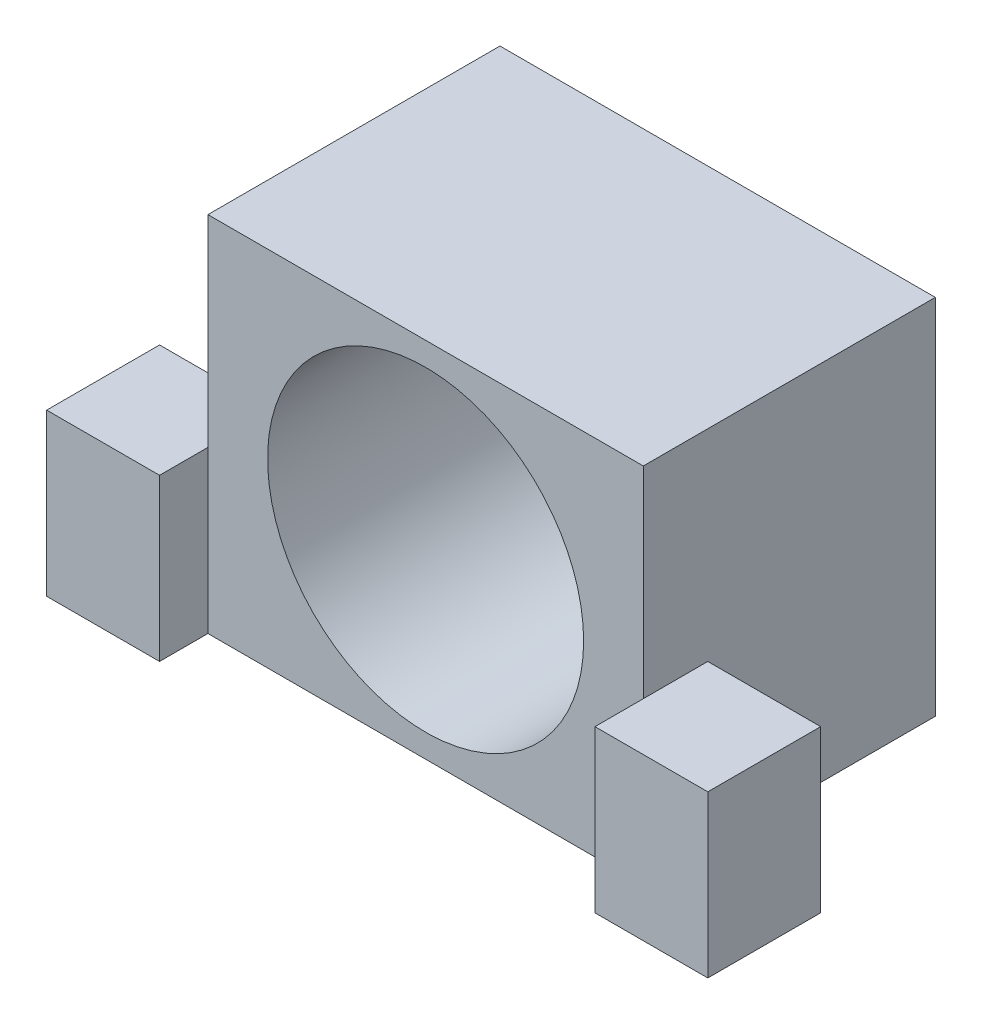
ISO-10303-21;
HEADER;
FILE_DESCRIPTION(('STEP AP214'),'2;1');
FILE_NAME('part.step','',(''),(''),'','','');
FILE_SCHEMA(('AUTOMOTIVE_DESIGN { 1 0 10303 214 1 1 1 1 }'));
ENDSEC;
DATA;
#1=APPLICATION_CONTEXT('core data for automotive mechanical design processes');
#2=APPLICATION_PROTOCOL_DEFINITION('international standard','automotive_design',2000,#1);
#3=PRODUCT_CONTEXT('',#1,'mechanical');
#4=PRODUCT('Part','Part','',(#3));
#5=PRODUCT_RELATED_PRODUCT_CATEGORY('part','',(#4));
#6=PRODUCT_DEFINITION_FORMATION('','',#4);
#7=PRODUCT_DEFINITION_CONTEXT('part definition',#1,'design');
#8=PRODUCT_DEFINITION('design','',#6,#7);
#9=PRODUCT_DEFINITION_SHAPE('','',#8);
#10=(LENGTH_UNIT() NAMED_UNIT(*) SI_UNIT(.MILLI.,.METRE.));
#11=(NAMED_UNIT(*) PLANE_ANGLE_UNIT() SI_UNIT($,.RADIAN.));
#12=(NAMED_UNIT(*) SI_UNIT($,.STERADIAN.) SOLID_ANGLE_UNIT());
#13=UNCERTAINTY_MEASURE_WITH_UNIT(LENGTH_MEASURE(1.E-05),#10,'distance_accuracy_value','');
#14=(GEOMETRIC_REPRESENTATION_CONTEXT(3) GLOBAL_UNCERTAINTY_ASSIGNED_CONTEXT((#13)) GLOBAL_UNIT_ASSIGNED_CONTEXT((#10,
#11,#12)) REPRESENTATION_CONTEXT('',''));
#15=CARTESIAN_POINT('',(0.,0.,0.));
#16=DIRECTION('',(0.,0.,1.));
#17=DIRECTION('',(1.,0.,0.));
#18=AXIS2_PLACEMENT_3D('',#15,#16,#17);
#19=CARTESIAN_POINT('',(17.145,14.2875,23.));
#20=DIRECTION('',(-1.,0.,0.));
#21=DIRECTION('',(0.,0.,1.));
#22=AXIS2_PLACEMENT_3D('',#19,#20,#21);
#23=PLANE('',#22);
#24=DIRECTION('',(0.,0.,1.));
#25=VECTOR('',#24,1.);
#26=CARTESIAN_POINT('',(17.145,-1.5875,17.92));
#27=LINE('',#26,#25);
#28=CARTESIAN_POINT('',(17.145,-1.5875,17.92));
#29=VERTEX_POINT('',#28);
#30=CARTESIAN_POINT('',(17.145,-1.5875,23.));
#31=VERTEX_POINT('',#30);
#32=EDGE_CURVE('E166',#29,#31,#27,.T.);
#33=ORIENTED_EDGE('',*,*,#32,.F.);
#34=DIRECTION('',(0.,-1.,0.));
#35=VECTOR('',#34,1.);
#36=CARTESIAN_POINT('',(17.145,-1.5875,17.92));
#37=LINE('',#36,#35);
#38=CARTESIAN_POINT('',(17.145,-14.2875,17.92));
#39=VERTEX_POINT('',#38);
#40=EDGE_CURVE('E158',#29,#39,#37,.T.);
#41=ORIENTED_EDGE('',*,*,#40,.T.);
#42=DIRECTION('',(0.,0.,-1.));
#43=VECTOR('',#42,1.);
#44=CARTESIAN_POINT('',(17.145,-14.2875,23.));
#45=LINE('',#44,#43);
#46=CARTESIAN_POINT('',(17.145,-14.2875,0.));
#47=VERTEX_POINT('',#46);
#48=EDGE_CURVE('E40',#39,#47,#45,.T.);
#49=ORIENTED_EDGE('',*,*,#48,.T.);
#50=DIRECTION('',(0.,1.,0.));
#51=VECTOR('',#50,1.);
#52=CARTESIAN_POINT('',(17.145,14.2875,0.));
#53=LINE('',#52,#51);
#54=CARTESIAN_POINT('',(17.145,14.2875,0.));
#55=VERTEX_POINT('',#54);
#56=EDGE_CURVE('E257',#47,#55,#53,.T.);
#57=ORIENTED_EDGE('',*,*,#56,.T.);
#58=DIRECTION('',(0.,0.,-1.));
#59=VECTOR('',#58,1.);
#60=CARTESIAN_POINT('',(17.145,14.2875,23.));
#61=LINE('',#60,#59);
#62=CARTESIAN_POINT('',(17.145,14.2875,23.));
#63=VERTEX_POINT('',#62);
#64=EDGE_CURVE('E263',#63,#55,#61,.T.);
#65=ORIENTED_EDGE('',*,*,#64,.F.);
#66=DIRECTION('',(0.,1.,0.));
#67=VECTOR('',#66,1.);
#68=CARTESIAN_POINT('',(17.145,14.2875,23.));
#69=LINE('',#68,#67);
#70=EDGE_CURVE('E248',#31,#63,#69,.T.);
#71=ORIENTED_EDGE('',*,*,#70,.F.);
#72=EDGE_LOOP('',(#33,#41,#49,#57,#65,#71));
#73=FACE_BOUND('',#72,.T.);
#74=ADVANCED_FACE('F32',(#73),#23,.F.);
#75=CARTESIAN_POINT('',(-17.145,14.2875,23.));
#76=DIRECTION('',(1.,0.,0.));
#77=DIRECTION('',(0.,0.,-1.));
#78=AXIS2_PLACEMENT_3D('',#75,#76,#77);
#79=PLANE('',#78);
#80=DIRECTION('',(0.,1.,0.));
#81=VECTOR('',#80,1.);
#82=CARTESIAN_POINT('',(-17.145,-1.5875,17.92));
#83=LINE('',#82,#81);
#84=CARTESIAN_POINT('',(-17.145,-14.2875,17.92));
#85=VERTEX_POINT('',#84);
#86=CARTESIAN_POINT('',(-17.145,-1.5875,17.92));
#87=VERTEX_POINT('',#86);
#88=EDGE_CURVE('E185',#85,#87,#83,.T.);
#89=ORIENTED_EDGE('',*,*,#88,.T.);
#90=DIRECTION('',(0.,0.,1.));
#91=VECTOR('',#90,1.);
#92=CARTESIAN_POINT('',(-17.145,-1.5875,17.92));
#93=LINE('',#92,#91);
#94=CARTESIAN_POINT('',(-17.145,-1.5875,23.));
#95=VERTEX_POINT('',#94);
#96=EDGE_CURVE('E203',#87,#95,#93,.T.);
#97=ORIENTED_EDGE('',*,*,#96,.T.);
#98=DIRECTION('',(0.,-1.,0.));
#99=VECTOR('',#98,1.);
#100=CARTESIAN_POINT('',(-17.145,14.2875,23.));
#101=LINE('',#100,#99);
#102=CARTESIAN_POINT('',(-17.145,14.2875,23.));
#103=VERTEX_POINT('',#102);
#104=EDGE_CURVE('E242',#103,#95,#101,.T.);
#105=ORIENTED_EDGE('',*,*,#104,.F.);
#106=DIRECTION('',(0.,0.,-1.));
#107=VECTOR('',#106,1.);
#108=CARTESIAN_POINT('',(-17.145,14.2875,23.));
#109=LINE('',#108,#107);
#110=CARTESIAN_POINT('',(-17.145,14.2875,0.));
#111=VERTEX_POINT('',#110);
#112=EDGE_CURVE('E252',#103,#111,#109,.T.);
#113=ORIENTED_EDGE('',*,*,#112,.T.);
#114=DIRECTION('',(0.,-1.,0.));
#115=VECTOR('',#114,1.);
#116=CARTESIAN_POINT('',(-17.145,14.2875,0.));
#117=LINE('',#116,#115);
#118=CARTESIAN_POINT('',(-17.145,-14.2875,0.));
#119=VERTEX_POINT('',#118);
#120=EDGE_CURVE('E239',#111,#119,#117,.T.);
#121=ORIENTED_EDGE('',*,*,#120,.T.);
#122=DIRECTION('',(0.,0.,-1.));
#123=VECTOR('',#122,1.);
#124=CARTESIAN_POINT('',(-17.145,-14.2875,23.));
#125=LINE('',#124,#123);
#126=EDGE_CURVE('E11',#85,#119,#125,.T.);
#127=ORIENTED_EDGE('',*,*,#126,.F.);
#128=EDGE_LOOP('',(#89,#97,#105,#113,#121,#127));
#129=FACE_BOUND('',#128,.T.);
#130=ADVANCED_FACE('F34',(#129),#79,.F.);
#131=CARTESIAN_POINT('',(17.145,-14.2875,23.));
#132=DIRECTION('',(0.,1.,0.));
#133=DIRECTION('',(0.,0.,1.));
#134=AXIS2_PLACEMENT_3D('',#131,#132,#133);
#135=PLANE('',#134);
#136=DIRECTION('',(1.,0.,0.));
#137=VECTOR('',#136,1.);
#138=CARTESIAN_POINT('',(17.145,-14.2875,0.));
#139=LINE('',#138,#137);
#140=EDGE_CURVE('E255',#119,#47,#139,.T.);
#141=ORIENTED_EDGE('',*,*,#140,.T.);
#142=ORIENTED_EDGE('',*,*,#48,.F.);
#143=DIRECTION('',(1.,0.,0.));
#144=VECTOR('',#143,1.);
#145=CARTESIAN_POINT('',(17.145,-14.2875,17.92));
#146=LINE('',#145,#144);
#147=CARTESIAN_POINT('',(26.035,-14.2875,17.92));
#148=VERTEX_POINT('',#147);
#149=EDGE_CURVE('E47',#39,#148,#146,.T.);
#150=ORIENTED_EDGE('',*,*,#149,.T.);
#151=DIRECTION('',(0.,0.,1.));
#152=VECTOR('',#151,1.);
#153=CARTESIAN_POINT('',(26.035,-14.2875,17.92));
#154=LINE('',#153,#152);
#155=CARTESIAN_POINT('',(26.035,-14.2875,26.81));
#156=VERTEX_POINT('',#155);
#157=EDGE_CURVE('E138',#148,#156,#154,.T.);
#158=ORIENTED_EDGE('',*,*,#157,.T.);
#159=DIRECTION('',(1.,0.,0.));
#160=VECTOR('',#159,1.);
#161=CARTESIAN_POINT('',(17.145,-14.2875,26.81));
#162=LINE('',#161,#160);
#163=CARTESIAN_POINT('',(17.145,-14.2875,26.81));
#164=VERTEX_POINT('',#163);
#165=EDGE_CURVE('E142',#164,#156,#162,.T.);
#166=ORIENTED_EDGE('',*,*,#165,.F.);
#167=DIRECTION('',(0.,0.,1.));
#168=VECTOR('',#167,1.);
#169=CARTESIAN_POINT('',(17.145,-14.2875,17.92));
#170=LINE('',#169,#168);
#171=CARTESIAN_POINT('',(17.145,-14.2875,23.));
#172=VERTEX_POINT('',#171);
#173=EDGE_CURVE('E128',#172,#164,#170,.T.);
#174=ORIENTED_EDGE('',*,*,#173,.F.);
#175=DIRECTION('',(1.,0.,0.));
#176=VECTOR('',#175,1.);
#177=CARTESIAN_POINT('',(17.145,-14.2875,23.));
#178=LINE('',#177,#176);
#179=CARTESIAN_POINT('',(-17.145,-14.2875,23.));
#180=VERTEX_POINT('',#179);
#181=EDGE_CURVE('E245',#180,#172,#178,.T.);
#182=ORIENTED_EDGE('',*,*,#181,.F.);
#183=DIRECTION('',(0.,0.,1.));
#184=VECTOR('',#183,1.);
#185=CARTESIAN_POINT('',(-17.145,-14.2875,17.92));
#186=LINE('',#185,#184);
#187=CARTESIAN_POINT('',(-17.145,-14.2875,26.81));
#188=VERTEX_POINT('',#187);
#189=EDGE_CURVE('E196',#180,#188,#186,.T.);
#190=ORIENTED_EDGE('',*,*,#189,.T.);
#191=DIRECTION('',(1.,0.,0.));
#192=VECTOR('',#191,1.);
#193=CARTESIAN_POINT('',(-17.145,-14.2875,26.81));
#194=LINE('',#193,#192);
#195=CARTESIAN_POINT('',(-26.035,-14.2875,26.81));
#196=VERTEX_POINT('',#195);
#197=EDGE_CURVE('E182',#196,#188,#194,.T.);
#198=ORIENTED_EDGE('',*,*,#197,.F.);
#199=DIRECTION('',(0.,0.,1.));
#200=VECTOR('',#199,1.);
#201=CARTESIAN_POINT('',(-26.035,-14.2875,17.92));
#202=LINE('',#201,#200);
#203=CARTESIAN_POINT('',(-26.035,-14.2875,17.92));
#204=VERTEX_POINT('',#203);
#205=EDGE_CURVE('E199',#204,#196,#202,.T.);
#206=ORIENTED_EDGE('',*,*,#205,.F.);
#207=DIRECTION('',(1.,0.,0.));
#208=VECTOR('',#207,1.);
#209=CARTESIAN_POINT('',(-17.145,-14.2875,17.92));
#210=LINE('',#209,#208);
#211=EDGE_CURVE('E192',#204,#85,#210,.T.);
#212=ORIENTED_EDGE('',*,*,#211,.T.);
#213=ORIENTED_EDGE('',*,*,#126,.T.);
#214=EDGE_LOOP('',(#141,#142,#150,#158,#166,#174,#182,#190,#198,#206,#212,#213));
#215=FACE_BOUND('',#214,.T.);
#216=ADVANCED_FACE('F144',(#215),#135,.F.);
#217=CARTESIAN_POINT('',(-17.145,14.2875,23.));
#218=DIRECTION('',(0.,-1.,0.));
#219=DIRECTION('',(0.,0.,-1.));
#220=AXIS2_PLACEMENT_3D('',#217,#218,#219);
#221=PLANE('',#220);
#222=DIRECTION('',(-1.,0.,0.));
#223=VECTOR('',#222,1.);
#224=CARTESIAN_POINT('',(-17.145,14.2875,0.));
#225=LINE('',#224,#223);
#226=EDGE_CURVE('E259',#55,#111,#225,.T.);
#227=ORIENTED_EDGE('',*,*,#226,.T.);
#228=ORIENTED_EDGE('',*,*,#112,.F.);
#229=DIRECTION('',(-1.,0.,0.));
#230=VECTOR('',#229,1.);
#231=CARTESIAN_POINT('',(-17.145,14.2875,23.));
#232=LINE('',#231,#230);
#233=EDGE_CURVE('E250',#63,#103,#232,.T.);
#234=ORIENTED_EDGE('',*,*,#233,.F.);
#235=ORIENTED_EDGE('',*,*,#64,.T.);
#236=EDGE_LOOP('',(#227,#228,#234,#235));
#237=FACE_BOUND('',#236,.T.);
#238=ADVANCED_FACE('F278',(#237),#221,.F.);
#239=CARTESIAN_POINT('',(0.,0.,23.));
#240=DIRECTION('',(0.,0.,-1.));
#241=DIRECTION('',(-1.,0.,0.));
#242=AXIS2_PLACEMENT_3D('',#239,#240,#241);
#243=PLANE('',#242);
#244=CARTESIAN_POINT('',(0.,0.,23.));
#245=DIRECTION('',(0.,0.,1.));
#246=DIRECTION('',(1.,0.,0.));
#247=AXIS2_PLACEMENT_3D('',#244,#245,#246);
#248=CIRCLE('',#247,12.446);
#249=CARTESIAN_POINT('',(12.446,0.,23.));
#250=VERTEX_POINT('',#249);
#251=EDGE_CURVE('E233',#250,#250,#248,.T.);
#252=ORIENTED_EDGE('',*,*,#251,.F.);
#253=EDGE_LOOP('',(#252));
#254=FACE_BOUND('',#253,.T.);
#255=ORIENTED_EDGE('',*,*,#104,.T.);
#256=EDGE_CURVE('E246',#95,#180,#101,.T.);
#257=ORIENTED_EDGE('',*,*,#256,.T.);
#258=ORIENTED_EDGE('',*,*,#181,.T.);
#259=EDGE_CURVE('E134',#172,#31,#69,.T.);
#260=ORIENTED_EDGE('',*,*,#259,.T.);
#261=ORIENTED_EDGE('',*,*,#70,.T.);
#262=ORIENTED_EDGE('',*,*,#233,.T.);
#263=EDGE_LOOP('',(#255,#257,#258,#260,#261,#262));
#264=FACE_BOUND('',#263,.T.);
#265=ADVANCED_FACE('F284',(#254,#264),#243,.F.);
#266=CARTESIAN_POINT('',(0.,0.,0.));
#267=DIRECTION('',(0.,0.,-1.));
#268=DIRECTION('',(-1.,0.,0.));
#269=AXIS2_PLACEMENT_3D('',#266,#267,#268);
#270=PLANE('',#269);
#271=CARTESIAN_POINT('',(0.,0.,0.));
#272=DIRECTION('',(0.,0.,1.));
#273=DIRECTION('',(1.,0.,0.));
#274=AXIS2_PLACEMENT_3D('',#271,#272,#273);
#275=CIRCLE('',#274,3.75);
#276=CARTESIAN_POINT('',(3.75,0.,0.));
#277=VERTEX_POINT('',#276);
#278=EDGE_CURVE('E213',#277,#277,#275,.T.);
#279=ORIENTED_EDGE('',*,*,#278,.T.);
#280=EDGE_LOOP('',(#279));
#281=FACE_BOUND('',#280,.T.);
#282=CARTESIAN_POINT('',(0.,-8.5,0.));
#283=DIRECTION('',(0.,0.,1.));
#284=DIRECTION('',(1.,0.,0.));
#285=AXIS2_PLACEMENT_3D('',#282,#283,#284);
#286=CIRCLE('',#285,1.625);
#287=CARTESIAN_POINT('',(1.625,-8.5,0.));
#288=VERTEX_POINT('',#287);
#289=EDGE_CURVE('E206',#288,#288,#286,.T.);
#290=ORIENTED_EDGE('',*,*,#289,.T.);
#291=EDGE_LOOP('',(#290));
#292=FACE_BOUND('',#291,.T.);
#293=CARTESIAN_POINT('',(8.5,0.,0.));
#294=DIRECTION('',(0.,0.,1.));
#295=DIRECTION('',(1.,0.,0.));
#296=AXIS2_PLACEMENT_3D('',#293,#294,#295);
#297=CIRCLE('',#296,1.625);
#298=CARTESIAN_POINT('',(10.125,0.,0.));
#299=VERTEX_POINT('',#298);
#300=EDGE_CURVE('E225',#299,#299,#297,.T.);
#301=ORIENTED_EDGE('',*,*,#300,.T.);
#302=EDGE_LOOP('',(#301));
#303=FACE_BOUND('',#302,.T.);
#304=CARTESIAN_POINT('',(-8.5,0.,0.));
#305=DIRECTION('',(0.,0.,1.));
#306=DIRECTION('',(1.,0.,0.));
#307=AXIS2_PLACEMENT_3D('',#304,#305,#306);
#308=CIRCLE('',#307,1.625);
#309=CARTESIAN_POINT('',(-6.875,0.,0.));
#310=VERTEX_POINT('',#309);
#311=EDGE_CURVE('E218',#310,#310,#308,.T.);
#312=ORIENTED_EDGE('',*,*,#311,.T.);
#313=EDGE_LOOP('',(#312));
#314=FACE_BOUND('',#313,.T.);
#315=CARTESIAN_POINT('',(0.,8.5,0.));
#316=DIRECTION('',(0.,0.,1.));
#317=DIRECTION('',(1.,0.,0.));
#318=AXIS2_PLACEMENT_3D('',#315,#316,#317);
#319=CIRCLE('',#318,1.625);
#320=CARTESIAN_POINT('',(1.625,8.5,0.));
#321=VERTEX_POINT('',#320);
#322=EDGE_CURVE('E230',#321,#321,#319,.T.);
#323=ORIENTED_EDGE('',*,*,#322,.T.);
#324=EDGE_LOOP('',(#323));
#325=FACE_BOUND('',#324,.T.);
#326=ORIENTED_EDGE('',*,*,#120,.F.);
#327=ORIENTED_EDGE('',*,*,#226,.F.);
#328=ORIENTED_EDGE('',*,*,#56,.F.);
#329=ORIENTED_EDGE('',*,*,#140,.F.);
#330=EDGE_LOOP('',(#326,#327,#328,#329));
#331=FACE_BOUND('',#330,.T.);
#332=ADVANCED_FACE('F275',(#281,#292,#303,#314,#325,#331),#270,.T.);
#333=CARTESIAN_POINT('',(0.,0.,2.));
#334=DIRECTION('',(0.,0.,1.));
#335=DIRECTION('',(1.,0.,0.));
#336=AXIS2_PLACEMENT_3D('',#333,#334,#335);
#337=CYLINDRICAL_SURFACE('',#336,12.446);
#338=CARTESIAN_POINT('',(0.,0.,2.));
#339=DIRECTION('',(0.,0.,1.));
#340=DIRECTION('',(1.,0.,0.));
#341=AXIS2_PLACEMENT_3D('',#338,#339,#340);
#342=CIRCLE('',#341,12.446);
#343=CARTESIAN_POINT('',(12.446,0.,2.));
#344=VERTEX_POINT('',#343);
#345=EDGE_CURVE('E236',#344,#344,#342,.T.);
#346=ORIENTED_EDGE('',*,*,#345,.F.);
#347=EDGE_LOOP('',(#346));
#348=FACE_BOUND('',#347,.T.);
#349=ORIENTED_EDGE('',*,*,#251,.T.);
#350=EDGE_LOOP('',(#349));
#351=FACE_BOUND('',#350,.T.);
#352=ADVANCED_FACE('F320',(#348,#351),#337,.F.);
#353=CARTESIAN_POINT('',(0.,0.,2.));
#354=DIRECTION('',(0.,0.,1.));
#355=DIRECTION('',(1.,0.,0.));
#356=AXIS2_PLACEMENT_3D('',#353,#354,#355);
#357=PLANE('',#356);
#358=CARTESIAN_POINT('',(0.,0.,2.));
#359=DIRECTION('',(0.,0.,1.));
#360=DIRECTION('',(1.,0.,0.));
#361=AXIS2_PLACEMENT_3D('',#358,#359,#360);
#362=CIRCLE('',#361,3.75);
#363=CARTESIAN_POINT('',(3.75,0.,2.));
#364=VERTEX_POINT('',#363);
#365=EDGE_CURVE('E198',#364,#364,#362,.T.);
#366=ORIENTED_EDGE('',*,*,#365,.F.);
#367=EDGE_LOOP('',(#366));
#368=FACE_BOUND('',#367,.T.);
#369=CARTESIAN_POINT('',(0.,-8.5,2.));
#370=DIRECTION('',(0.,0.,1.));
#371=DIRECTION('',(1.,0.,0.));
#372=AXIS2_PLACEMENT_3D('',#369,#370,#371);
#373=CIRCLE('',#372,1.625);
#374=CARTESIAN_POINT('',(1.625,-8.5,2.));
#375=VERTEX_POINT('',#374);
#376=EDGE_CURVE('E210',#375,#375,#373,.T.);
#377=ORIENTED_EDGE('',*,*,#376,.F.);
#378=EDGE_LOOP('',(#377));
#379=FACE_BOUND('',#378,.T.);
#380=CARTESIAN_POINT('',(8.5,0.,2.));
#381=DIRECTION('',(0.,0.,1.));
#382=DIRECTION('',(1.,0.,0.));
#383=AXIS2_PLACEMENT_3D('',#380,#381,#382);
#384=CIRCLE('',#383,1.625);
#385=CARTESIAN_POINT('',(10.125,0.,2.));
#386=VERTEX_POINT('',#385);
#387=EDGE_CURVE('E209',#386,#386,#384,.T.);
#388=ORIENTED_EDGE('',*,*,#387,.F.);
#389=EDGE_LOOP('',(#388));
#390=FACE_BOUND('',#389,.T.);
#391=CARTESIAN_POINT('',(-8.5,0.,2.));
#392=DIRECTION('',(0.,0.,1.));
#393=DIRECTION('',(1.,0.,0.));
#394=AXIS2_PLACEMENT_3D('',#391,#392,#393);
#395=CIRCLE('',#394,1.625);
#396=CARTESIAN_POINT('',(-6.875,0.,2.));
#397=VERTEX_POINT('',#396);
#398=EDGE_CURVE('E222',#397,#397,#395,.T.);
#399=ORIENTED_EDGE('',*,*,#398,.F.);
#400=EDGE_LOOP('',(#399));
#401=FACE_BOUND('',#400,.T.);
#402=CARTESIAN_POINT('',(0.,8.5,2.));
#403=DIRECTION('',(0.,0.,1.));
#404=DIRECTION('',(1.,0.,0.));
#405=AXIS2_PLACEMENT_3D('',#402,#403,#404);
#406=CIRCLE('',#405,1.625);
#407=CARTESIAN_POINT('',(1.625,8.5,2.));
#408=VERTEX_POINT('',#407);
#409=EDGE_CURVE('E221',#408,#408,#406,.T.);
#410=ORIENTED_EDGE('',*,*,#409,.F.);
#411=EDGE_LOOP('',(#410));
#412=FACE_BOUND('',#411,.T.);
#413=ORIENTED_EDGE('',*,*,#345,.T.);
#414=EDGE_LOOP('',(#413));
#415=FACE_BOUND('',#414,.T.);
#416=ADVANCED_FACE('F326',(#368,#379,#390,#401,#412,#415),#357,.T.);
#417=CARTESIAN_POINT('',(0.,8.5,0.));
#418=DIRECTION('',(0.,0.,1.));
#419=DIRECTION('',(1.,0.,0.));
#420=AXIS2_PLACEMENT_3D('',#417,#418,#419);
#421=CYLINDRICAL_SURFACE('',#420,1.625);
#422=ORIENTED_EDGE('',*,*,#322,.F.);
#423=EDGE_LOOP('',(#422));
#424=FACE_BOUND('',#423,.T.);
#425=ORIENTED_EDGE('',*,*,#409,.T.);
#426=EDGE_LOOP('',(#425));
#427=FACE_BOUND('',#426,.T.);
#428=ADVANCED_FACE('F330',(#424,#427),#421,.F.);
#429=CARTESIAN_POINT('',(-8.5,0.,0.));
#430=DIRECTION('',(0.,0.,1.));
#431=DIRECTION('',(1.,0.,0.));
#432=AXIS2_PLACEMENT_3D('',#429,#430,#431);
#433=CYLINDRICAL_SURFACE('',#432,1.625);
#434=ORIENTED_EDGE('',*,*,#311,.F.);
#435=EDGE_LOOP('',(#434));
#436=FACE_BOUND('',#435,.T.);
#437=ORIENTED_EDGE('',*,*,#398,.T.);
#438=EDGE_LOOP('',(#437));
#439=FACE_BOUND('',#438,.T.);
#440=ADVANCED_FACE('F334',(#436,#439),#433,.F.);
#441=CARTESIAN_POINT('',(8.5,0.,0.));
#442=DIRECTION('',(0.,0.,1.));
#443=DIRECTION('',(1.,0.,0.));
#444=AXIS2_PLACEMENT_3D('',#441,#442,#443);
#445=CYLINDRICAL_SURFACE('',#444,1.625);
#446=ORIENTED_EDGE('',*,*,#300,.F.);
#447=EDGE_LOOP('',(#446));
#448=FACE_BOUND('',#447,.T.);
#449=ORIENTED_EDGE('',*,*,#387,.T.);
#450=EDGE_LOOP('',(#449));
#451=FACE_BOUND('',#450,.T.);
#452=ADVANCED_FACE('F336',(#448,#451),#445,.F.);
#453=CARTESIAN_POINT('',(0.,-8.5,0.));
#454=DIRECTION('',(0.,0.,1.));
#455=DIRECTION('',(1.,0.,0.));
#456=AXIS2_PLACEMENT_3D('',#453,#454,#455);
#457=CYLINDRICAL_SURFACE('',#456,1.625);
#458=ORIENTED_EDGE('',*,*,#289,.F.);
#459=EDGE_LOOP('',(#458));
#460=FACE_BOUND('',#459,.T.);
#461=ORIENTED_EDGE('',*,*,#376,.T.);
#462=EDGE_LOOP('',(#461));
#463=FACE_BOUND('',#462,.T.);
#464=ADVANCED_FACE('F339',(#460,#463),#457,.F.);
#465=CARTESIAN_POINT('',(0.,0.,0.));
#466=DIRECTION('',(0.,0.,1.));
#467=DIRECTION('',(1.,0.,0.));
#468=AXIS2_PLACEMENT_3D('',#465,#466,#467);
#469=CYLINDRICAL_SURFACE('',#468,3.75);
#470=ORIENTED_EDGE('',*,*,#278,.F.);
#471=EDGE_LOOP('',(#470));
#472=FACE_BOUND('',#471,.T.);
#473=ORIENTED_EDGE('',*,*,#365,.T.);
#474=EDGE_LOOP('',(#473));
#475=FACE_BOUND('',#474,.T.);
#476=ADVANCED_FACE('F344',(#472,#475),#469,.F.);
#477=CARTESIAN_POINT('',(-17.145,-1.5875,17.92));
#478=DIRECTION('',(1.,0.,0.));
#479=DIRECTION('',(0.,0.,-1.));
#480=AXIS2_PLACEMENT_3D('',#477,#478,#479);
#481=PLANE('',#480);
#482=ORIENTED_EDGE('',*,*,#256,.F.);
#483=CARTESIAN_POINT('',(-17.145,-1.5875,26.81));
#484=VERTEX_POINT('',#483);
#485=EDGE_CURVE('E195',#95,#484,#93,.T.);
#486=ORIENTED_EDGE('',*,*,#485,.T.);
#487=DIRECTION('',(0.,1.,0.));
#488=VECTOR('',#487,1.);
#489=CARTESIAN_POINT('',(-17.145,-1.5875,26.81));
#490=LINE('',#489,#488);
#491=EDGE_CURVE('E169',#188,#484,#490,.T.);
#492=ORIENTED_EDGE('',*,*,#491,.F.);
#493=ORIENTED_EDGE('',*,*,#189,.F.);
#494=EDGE_LOOP('',(#482,#486,#492,#493));
#495=FACE_BOUND('',#494,.T.);
#496=ADVANCED_FACE('F347',(#495),#481,.T.);
#497=CARTESIAN_POINT('',(-26.035,-1.5875,17.92));
#498=DIRECTION('',(-1.,0.,0.));
#499=DIRECTION('',(0.,-1.,0.));
#500=AXIS2_PLACEMENT_3D('',#497,#498,#499);
#501=PLANE('',#500);
#502=ORIENTED_EDGE('',*,*,#205,.T.);
#503=DIRECTION('',(0.,-1.,0.));
#504=VECTOR('',#503,1.);
#505=CARTESIAN_POINT('',(-26.035,-1.5875,26.81));
#506=LINE('',#505,#504);
#507=CARTESIAN_POINT('',(-26.035,-1.5875,26.81));
#508=VERTEX_POINT('',#507);
#509=EDGE_CURVE('E179',#508,#196,#506,.T.);
#510=ORIENTED_EDGE('',*,*,#509,.F.);
#511=DIRECTION('',(0.,0.,1.));
#512=VECTOR('',#511,1.);
#513=CARTESIAN_POINT('',(-26.035,-1.5875,17.92));
#514=LINE('',#513,#512);
#515=CARTESIAN_POINT('',(-26.035,-1.5875,17.92));
#516=VERTEX_POINT('',#515);
#517=EDGE_CURVE('E201',#516,#508,#514,.T.);
#518=ORIENTED_EDGE('',*,*,#517,.F.);
#519=DIRECTION('',(0.,-1.,0.));
#520=VECTOR('',#519,1.);
#521=CARTESIAN_POINT('',(-26.035,-1.5875,17.92));
#522=LINE('',#521,#520);
#523=EDGE_CURVE('E189',#516,#204,#522,.T.);
#524=ORIENTED_EDGE('',*,*,#523,.T.);
#525=EDGE_LOOP('',(#502,#510,#518,#524));
#526=FACE_BOUND('',#525,.T.);
#527=ADVANCED_FACE('F354',(#526),#501,.T.);
#528=CARTESIAN_POINT('',(-17.145,-1.5875,17.92));
#529=DIRECTION('',(0.,1.,0.));
#530=DIRECTION('',(-1.,0.,0.));
#531=AXIS2_PLACEMENT_3D('',#528,#529,#530);
#532=PLANE('',#531);
#533=ORIENTED_EDGE('',*,*,#517,.T.);
#534=DIRECTION('',(-1.,0.,0.));
#535=VECTOR('',#534,1.);
#536=CARTESIAN_POINT('',(-17.145,-1.5875,26.81));
#537=LINE('',#536,#535);
#538=EDGE_CURVE('E176',#484,#508,#537,.T.);
#539=ORIENTED_EDGE('',*,*,#538,.F.);
#540=ORIENTED_EDGE('',*,*,#485,.F.);
#541=ORIENTED_EDGE('',*,*,#96,.F.);
#542=DIRECTION('',(-1.,0.,0.));
#543=VECTOR('',#542,1.);
#544=CARTESIAN_POINT('',(-17.145,-1.5875,17.92));
#545=LINE('',#544,#543);
#546=EDGE_CURVE('E55',#87,#516,#545,.T.);
#547=ORIENTED_EDGE('',*,*,#546,.T.);
#548=EDGE_LOOP('',(#533,#539,#540,#541,#547));
#549=FACE_BOUND('',#548,.T.);
#550=ADVANCED_FACE('F356',(#549),#532,.T.);
#551=CARTESIAN_POINT('',(0.,0.,17.92));
#552=DIRECTION('',(0.,0.,-1.));
#553=DIRECTION('',(-1.,0.,0.));
#554=AXIS2_PLACEMENT_3D('',#551,#552,#553);
#555=PLANE('',#554);
#556=ORIENTED_EDGE('',*,*,#88,.F.);
#557=ORIENTED_EDGE('',*,*,#211,.F.);
#558=ORIENTED_EDGE('',*,*,#523,.F.);
#559=ORIENTED_EDGE('',*,*,#546,.F.);
#560=EDGE_LOOP('',(#556,#557,#558,#559));
#561=FACE_BOUND('',#560,.T.);
#562=ADVANCED_FACE('F359',(#561),#555,.T.);
#563=CARTESIAN_POINT('',(0.,0.,26.81));
#564=DIRECTION('',(0.,0.,-1.));
#565=DIRECTION('',(-1.,0.,0.));
#566=AXIS2_PLACEMENT_3D('',#563,#564,#565);
#567=PLANE('',#566);
#568=ORIENTED_EDGE('',*,*,#491,.T.);
#569=ORIENTED_EDGE('',*,*,#538,.T.);
#570=ORIENTED_EDGE('',*,*,#509,.T.);
#571=ORIENTED_EDGE('',*,*,#197,.T.);
#572=EDGE_LOOP('',(#568,#569,#570,#571));
#573=FACE_BOUND('',#572,.T.);
#574=ADVANCED_FACE('F366',(#573),#567,.F.);
#575=CARTESIAN_POINT('',(17.145,-1.5875,17.92));
#576=DIRECTION('',(-1.,0.,0.));
#577=DIRECTION('',(0.,0.,1.));
#578=AXIS2_PLACEMENT_3D('',#575,#576,#577);
#579=PLANE('',#578);
#580=ORIENTED_EDGE('',*,*,#259,.F.);
#581=ORIENTED_EDGE('',*,*,#173,.T.);
#582=DIRECTION('',(0.,-1.,0.));
#583=VECTOR('',#582,1.);
#584=CARTESIAN_POINT('',(17.145,-1.5875,26.81));
#585=LINE('',#584,#583);
#586=CARTESIAN_POINT('',(17.145,-1.5875,26.81));
#587=VERTEX_POINT('',#586);
#588=EDGE_CURVE('E132',#587,#164,#585,.T.);
#589=ORIENTED_EDGE('',*,*,#588,.F.);
#590=EDGE_CURVE('E170',#31,#587,#27,.T.);
#591=ORIENTED_EDGE('',*,*,#590,.F.);
#592=EDGE_LOOP('',(#580,#581,#589,#591));
#593=FACE_BOUND('',#592,.T.);
#594=ADVANCED_FACE('F130',(#593),#579,.T.);
#595=CARTESIAN_POINT('',(17.145,-1.5875,17.92));
#596=DIRECTION('',(0.,1.,0.));
#597=DIRECTION('',(-1.,0.,0.));
#598=AXIS2_PLACEMENT_3D('',#595,#596,#597);
#599=PLANE('',#598);
#600=ORIENTED_EDGE('',*,*,#32,.T.);
#601=ORIENTED_EDGE('',*,*,#590,.T.);
#602=DIRECTION('',(-1.,0.,0.));
#603=VECTOR('',#602,1.);
#604=CARTESIAN_POINT('',(17.145,-1.5875,26.81));
#605=LINE('',#604,#603);
#606=CARTESIAN_POINT('',(26.035,-1.58749999999999,26.81));
#607=VERTEX_POINT('',#606);
#608=EDGE_CURVE('E153',#607,#587,#605,.T.);
#609=ORIENTED_EDGE('',*,*,#608,.F.);
#610=DIRECTION('',(0.,0.,1.));
#611=VECTOR('',#610,1.);
#612=CARTESIAN_POINT('',(26.035,-1.58749999999999,17.92));
#613=LINE('',#612,#611);
#614=CARTESIAN_POINT('',(26.035,-1.58749999999999,17.92));
#615=VERTEX_POINT('',#614);
#616=EDGE_CURVE('E171',#615,#607,#613,.T.);
#617=ORIENTED_EDGE('',*,*,#616,.F.);
#618=DIRECTION('',(-1.,0.,0.));
#619=VECTOR('',#618,1.);
#620=CARTESIAN_POINT('',(17.145,-1.5875,17.92));
#621=LINE('',#620,#619);
#622=EDGE_CURVE('E139',#615,#29,#621,.T.);
#623=ORIENTED_EDGE('',*,*,#622,.T.);
#624=EDGE_LOOP('',(#600,#601,#609,#617,#623));
#625=FACE_BOUND('',#624,.T.);
#626=ADVANCED_FACE('F287',(#625),#599,.T.);
#627=CARTESIAN_POINT('',(26.035,-1.58749999999999,17.92));
#628=DIRECTION('',(1.,0.,0.));
#629=DIRECTION('',(0.,1.,0.));
#630=AXIS2_PLACEMENT_3D('',#627,#628,#629);
#631=PLANE('',#630);
#632=ORIENTED_EDGE('',*,*,#616,.T.);
#633=DIRECTION('',(0.,1.,0.));
#634=VECTOR('',#633,1.);
#635=CARTESIAN_POINT('',(26.035,-1.58749999999999,26.81));
#636=LINE('',#635,#634);
#637=EDGE_CURVE('E148',#156,#607,#636,.T.);
#638=ORIENTED_EDGE('',*,*,#637,.F.);
#639=ORIENTED_EDGE('',*,*,#157,.F.);
#640=DIRECTION('',(0.,1.,0.));
#641=VECTOR('',#640,1.);
#642=CARTESIAN_POINT('',(26.035,-1.58749999999999,17.92));
#643=LINE('',#642,#641);
#644=EDGE_CURVE('E161',#148,#615,#643,.T.);
#645=ORIENTED_EDGE('',*,*,#644,.T.);
#646=EDGE_LOOP('',(#632,#638,#639,#645));
#647=FACE_BOUND('',#646,.T.);
#648=ADVANCED_FACE('F291',(#647),#631,.T.);
#649=CARTESIAN_POINT('',(0.,0.,17.92));
#650=DIRECTION('',(0.,0.,1.));
#651=DIRECTION('',(1.,0.,0.));
#652=AXIS2_PLACEMENT_3D('',#649,#650,#651);
#653=PLANE('',#652);
#654=ORIENTED_EDGE('',*,*,#40,.F.);
#655=ORIENTED_EDGE('',*,*,#622,.F.);
#656=ORIENTED_EDGE('',*,*,#644,.F.);
#657=ORIENTED_EDGE('',*,*,#149,.F.);
#658=EDGE_LOOP('',(#654,#655,#656,#657));
#659=FACE_BOUND('',#658,.T.);
#660=ADVANCED_FACE('F289',(#659),#653,.F.);
#661=CARTESIAN_POINT('',(0.,0.,26.81));
#662=DIRECTION('',(0.,0.,1.));
#663=DIRECTION('',(1.,0.,0.));
#664=AXIS2_PLACEMENT_3D('',#661,#662,#663);
#665=PLANE('',#664);
#666=ORIENTED_EDGE('',*,*,#588,.T.);
#667=ORIENTED_EDGE('',*,*,#165,.T.);
#668=ORIENTED_EDGE('',*,*,#637,.T.);
#669=ORIENTED_EDGE('',*,*,#608,.T.);
#670=EDGE_LOOP('',(#666,#667,#668,#669));
#671=FACE_BOUND('',#670,.T.);
#672=ADVANCED_FACE('F151',(#671),#665,.T.);
#673=CLOSED_SHELL('',(#74,#130,#216,#238,#265,#332,#352,#416,#428,#440,#452,#464,#476,#496,#527,
#550,#562,#574,#594,#626,#648,#660,#672));
#674=MANIFOLD_SOLID_BREP('B2',#673);
#675=ADVANCED_BREP_SHAPE_REPRESENTATION('',(#18,#674),#14);
#676=SHAPE_DEFINITION_REPRESENTATION(#9,#675);
ENDSEC;
END-ISO-10303-21;
